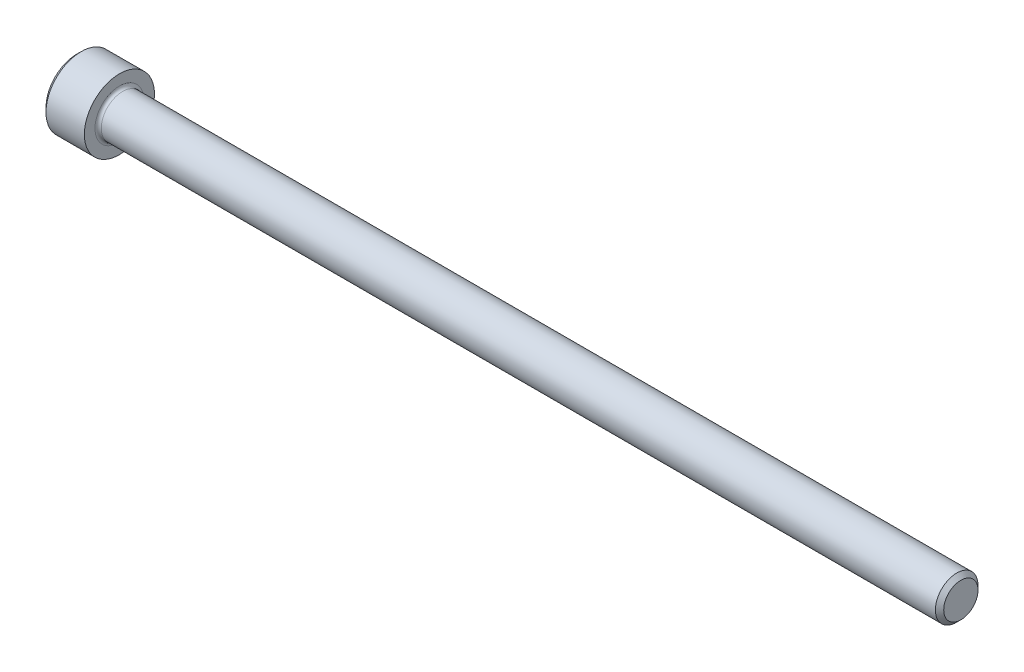
ISO-10303-21;
HEADER;
FILE_DESCRIPTION(('STEP AP214'),'2;1');
FILE_NAME('part.step','',(''),(''),'','','');
FILE_SCHEMA(('AUTOMOTIVE_DESIGN { 1 0 10303 214 1 1 1 1 }'));
ENDSEC;
DATA;
#1=APPLICATION_CONTEXT('core data for automotive mechanical design processes');
#2=APPLICATION_PROTOCOL_DEFINITION('international standard','automotive_design',2000,#1);
#3=PRODUCT_CONTEXT('',#1,'mechanical');
#4=PRODUCT('Part','Part','',(#3));
#5=PRODUCT_RELATED_PRODUCT_CATEGORY('part','',(#4));
#6=PRODUCT_DEFINITION_FORMATION('','',#4);
#7=PRODUCT_DEFINITION_CONTEXT('part definition',#1,'design');
#8=PRODUCT_DEFINITION('design','',#6,#7);
#9=PRODUCT_DEFINITION_SHAPE('','',#8);
#10=(LENGTH_UNIT() NAMED_UNIT(*) SI_UNIT(.MILLI.,.METRE.));
#11=(NAMED_UNIT(*) PLANE_ANGLE_UNIT() SI_UNIT($,.RADIAN.));
#12=(NAMED_UNIT(*) SI_UNIT($,.STERADIAN.) SOLID_ANGLE_UNIT());
#13=UNCERTAINTY_MEASURE_WITH_UNIT(LENGTH_MEASURE(1.E-05),#10,'distance_accuracy_value','');
#14=(GEOMETRIC_REPRESENTATION_CONTEXT(3) GLOBAL_UNCERTAINTY_ASSIGNED_CONTEXT((#13)) GLOBAL_UNIT_ASSIGNED_CONTEXT((#10,
#11,#12)) REPRESENTATION_CONTEXT('',''));
#15=CARTESIAN_POINT('',(0.,0.,0.));
#16=DIRECTION('',(0.,0.,1.));
#17=DIRECTION('',(1.,0.,0.));
#18=AXIS2_PLACEMENT_3D('',#15,#16,#17);
#19=CARTESIAN_POINT('',(2.286,3.4381381735323,-1.98501));
#20=DIRECTION('',(1.,0.,0.));
#21=DIRECTION('',(0.,0.,-1.));
#22=AXIS2_PLACEMENT_3D('',#19,#20,#21);
#23=PLANE('',#22);
#24=DIRECTION('',(0.,1.,0.));
#25=VECTOR('',#24,1.);
#26=CARTESIAN_POINT('',(2.286,3.4381381735323,1.98501));
#27=LINE('',#26,#25);
#28=CARTESIAN_POINT('',(2.28600000001322,0.,1.98500999999925));
#29=VERTEX_POINT('',#28);
#30=CARTESIAN_POINT('',(2.286,-1.14604605784409,1.98501));
#31=VERTEX_POINT('',#30);
#32=EDGE_CURVE('E96',#29,#31,#27,.F.);
#33=ORIENTED_EDGE('',*,*,#32,.F.);
#34=CARTESIAN_POINT('',(2.28600000002643,0.,0.));
#35=DIRECTION('',(-1.,0.,0.));
#36=DIRECTION('',(0.,0.,1.));
#37=AXIS2_PLACEMENT_3D('',#34,#35,#36);
#38=CIRCLE('',#37,1.98500999999851);
#39=CARTESIAN_POINT('',(2.28600000001322,-1.7190690867655,0.992504999999628));
#40=VERTEX_POINT('',#39);
#41=EDGE_CURVE('E98',#29,#40,#38,.F.);
#42=ORIENTED_EDGE('',*,*,#41,.T.);
#43=DIRECTION('',(0.,-0.500000000000001,-0.866025403784438));
#44=VECTOR('',#43,1.);
#45=CARTESIAN_POINT('',(2.286,-1.14604605784409,1.98501));
#46=LINE('',#45,#44);
#47=EDGE_CURVE('E101',#31,#40,#46,.T.);
#48=ORIENTED_EDGE('',*,*,#47,.F.);
#49=EDGE_LOOP('',(#33,#42,#48));
#50=FACE_BOUND('',#49,.T.);
#51=ADVANCED_FACE('F17',(#50),#23,.F.);
#52=CARTESIAN_POINT('',(2.286,3.4381381735323,-1.98501));
#53=DIRECTION('',(1.,0.,0.));
#54=DIRECTION('',(0.,0.,-1.));
#55=AXIS2_PLACEMENT_3D('',#52,#53,#54);
#56=PLANE('',#55);
#57=DIRECTION('',(0.,-0.500000000000001,-0.866025403784438));
#58=VECTOR('',#57,1.);
#59=CARTESIAN_POINT('',(2.286,-1.71906908676614,0.992504999999999));
#60=LINE('',#59,#58);
#61=CARTESIAN_POINT('',(2.286,-2.29209211568819,0.));
#62=VERTEX_POINT('',#61);
#63=EDGE_CURVE('E169',#40,#62,#60,.T.);
#64=ORIENTED_EDGE('',*,*,#63,.F.);
#65=CARTESIAN_POINT('',(2.28600000002643,0.,0.));
#66=DIRECTION('',(-1.,0.,0.));
#67=DIRECTION('',(0.,0.,1.));
#68=AXIS2_PLACEMENT_3D('',#65,#66,#67);
#69=CIRCLE('',#68,1.98500999999851);
#70=CARTESIAN_POINT('',(2.28600000001322,-1.7190690867655,-0.992504999999623));
#71=VERTEX_POINT('',#70);
#72=EDGE_CURVE('E116',#40,#71,#69,.F.);
#73=ORIENTED_EDGE('',*,*,#72,.T.);
#74=DIRECTION('',(0.,0.499999999999998,-0.86602540378444));
#75=VECTOR('',#74,1.);
#76=CARTESIAN_POINT('',(2.286,-2.29209211568819,0.));
#77=LINE('',#76,#75);
#78=EDGE_CURVE('E165',#62,#71,#77,.T.);
#79=ORIENTED_EDGE('',*,*,#78,.F.);
#80=EDGE_LOOP('',(#64,#73,#79));
#81=FACE_BOUND('',#80,.T.);
#82=ADVANCED_FACE('F341',(#81),#56,.F.);
#83=CARTESIAN_POINT('',(2.286,3.4381381735323,-1.98501));
#84=DIRECTION('',(1.,0.,0.));
#85=DIRECTION('',(0.,0.,-1.));
#86=AXIS2_PLACEMENT_3D('',#83,#84,#85);
#87=PLANE('',#86);
#88=DIRECTION('',(0.,0.499999999999998,-0.86602540378444));
#89=VECTOR('',#88,1.);
#90=CARTESIAN_POINT('',(2.286,-1.71906908676615,-0.992504999999995));
#91=LINE('',#90,#89);
#92=CARTESIAN_POINT('',(2.286,-1.1460460578441,-1.98501));
#93=VERTEX_POINT('',#92);
#94=EDGE_CURVE('E161',#71,#93,#91,.T.);
#95=ORIENTED_EDGE('',*,*,#94,.F.);
#96=CARTESIAN_POINT('',(2.28600000002643,0.,0.));
#97=DIRECTION('',(-1.,0.,0.));
#98=DIRECTION('',(0.,0.,1.));
#99=AXIS2_PLACEMENT_3D('',#96,#97,#98);
#100=CIRCLE('',#99,1.98500999999851);
#101=CARTESIAN_POINT('',(2.28600000001322,0.,-1.98500999999926));
#102=VERTEX_POINT('',#101);
#103=EDGE_CURVE('E218',#71,#102,#100,.F.);
#104=ORIENTED_EDGE('',*,*,#103,.T.);
#105=DIRECTION('',(0.,1.,0.));
#106=VECTOR('',#105,1.);
#107=CARTESIAN_POINT('',(2.286,3.4381381735323,-1.98501));
#108=LINE('',#107,#106);
#109=EDGE_CURVE('E157',#93,#102,#108,.T.);
#110=ORIENTED_EDGE('',*,*,#109,.F.);
#111=EDGE_LOOP('',(#95,#104,#110));
#112=FACE_BOUND('',#111,.T.);
#113=ADVANCED_FACE('F338',(#112),#87,.F.);
#114=CARTESIAN_POINT('',(2.286,3.4381381735323,-1.98501));
#115=DIRECTION('',(1.,0.,0.));
#116=DIRECTION('',(0.,0.,-1.));
#117=AXIS2_PLACEMENT_3D('',#114,#115,#116);
#118=PLANE('',#117);
#119=DIRECTION('',(0.,1.,0.));
#120=VECTOR('',#119,1.);
#121=CARTESIAN_POINT('',(2.286,3.4381381735323,-1.98501));
#122=LINE('',#121,#120);
#123=CARTESIAN_POINT('',(2.286,1.1460460578441,-1.98501));
#124=VERTEX_POINT('',#123);
#125=EDGE_CURVE('E153',#102,#124,#122,.T.);
#126=ORIENTED_EDGE('',*,*,#125,.F.);
#127=CARTESIAN_POINT('',(2.28600000002643,0.,0.));
#128=DIRECTION('',(-1.,0.,0.));
#129=DIRECTION('',(0.,0.,1.));
#130=AXIS2_PLACEMENT_3D('',#127,#128,#129);
#131=CIRCLE('',#130,1.98500999999851);
#132=CARTESIAN_POINT('',(2.28600000001322,1.7190690867655,-0.99250499999963));
#133=VERTEX_POINT('',#132);
#134=EDGE_CURVE('E215',#102,#133,#131,.F.);
#135=ORIENTED_EDGE('',*,*,#134,.T.);
#136=DIRECTION('',(0.,0.500000000000001,0.866025403784438));
#137=VECTOR('',#136,1.);
#138=CARTESIAN_POINT('',(2.286,1.1460460578441,-1.98501));
#139=LINE('',#138,#137);
#140=EDGE_CURVE('E149',#124,#133,#139,.T.);
#141=ORIENTED_EDGE('',*,*,#140,.F.);
#142=EDGE_LOOP('',(#126,#135,#141));
#143=FACE_BOUND('',#142,.T.);
#144=ADVANCED_FACE('F334',(#143),#118,.F.);
#145=CARTESIAN_POINT('',(2.286,3.4381381735323,-1.98501));
#146=DIRECTION('',(1.,0.,0.));
#147=DIRECTION('',(0.,0.,-1.));
#148=AXIS2_PLACEMENT_3D('',#145,#146,#147);
#149=PLANE('',#148);
#150=DIRECTION('',(0.,0.500000000000001,0.866025403784438));
#151=VECTOR('',#150,1.);
#152=CARTESIAN_POINT('',(2.286,1.71906908676615,-0.992505000000003));
#153=LINE('',#152,#151);
#154=CARTESIAN_POINT('',(2.286,2.2920921156882,0.));
#155=VERTEX_POINT('',#154);
#156=EDGE_CURVE('E145',#133,#155,#153,.T.);
#157=ORIENTED_EDGE('',*,*,#156,.F.);
#158=CARTESIAN_POINT('',(2.28600000002643,0.,0.));
#159=DIRECTION('',(-1.,0.,0.));
#160=DIRECTION('',(0.,0.,1.));
#161=AXIS2_PLACEMENT_3D('',#158,#159,#160);
#162=CIRCLE('',#161,1.98500999999851);
#163=CARTESIAN_POINT('',(2.28600000001322,1.71906908676551,0.992504999999625));
#164=VERTEX_POINT('',#163);
#165=EDGE_CURVE('E124',#133,#164,#162,.F.);
#166=ORIENTED_EDGE('',*,*,#165,.T.);
#167=DIRECTION('',(0.,-0.499999999999999,0.866025403784439));
#168=VECTOR('',#167,1.);
#169=CARTESIAN_POINT('',(2.286,2.2920921156882,0.));
#170=LINE('',#169,#168);
#171=EDGE_CURVE('E117',#155,#164,#170,.T.);
#172=ORIENTED_EDGE('',*,*,#171,.F.);
#173=EDGE_LOOP('',(#157,#166,#172));
#174=FACE_BOUND('',#173,.T.);
#175=ADVANCED_FACE('F330',(#174),#149,.F.);
#176=CARTESIAN_POINT('',(2.28600000002643,0.,0.));
#177=DIRECTION('',(-1.,0.,0.));
#178=DIRECTION('',(0.,0.,1.));
#179=AXIS2_PLACEMENT_3D('',#176,#177,#178);
#180=CONICAL_SURFACE('',#179,1.98500999999851,1.04719755119762);
#181=CARTESIAN_POINT('',(3.43204605781011,0.,5.6843418860808E-11));
#182=VERTEX_POINT('',#181);
#183=VERTEX_LOOP('',#182);
#184=FACE_BOUND('',#183,.T.);
#185=ORIENTED_EDGE('',*,*,#41,.F.);
#186=CARTESIAN_POINT('',(2.28600000002643,0.,0.));
#187=DIRECTION('',(-1.,0.,0.));
#188=DIRECTION('',(0.,0.,1.));
#189=AXIS2_PLACEMENT_3D('',#186,#187,#188);
#190=CIRCLE('',#189,1.98500999999851);
#191=EDGE_CURVE('E112',#29,#164,#190,.T.);
#192=ORIENTED_EDGE('',*,*,#191,.T.);
#193=ORIENTED_EDGE('',*,*,#165,.F.);
#194=ORIENTED_EDGE('',*,*,#134,.F.);
#195=ORIENTED_EDGE('',*,*,#103,.F.);
#196=ORIENTED_EDGE('',*,*,#72,.F.);
#197=EDGE_LOOP('',(#185,#192,#193,#194,#195,#196));
#198=FACE_BOUND('',#197,.T.);
#199=ADVANCED_FACE('F110',(#184,#198),#180,.F.);
#200=CARTESIAN_POINT('',(2.286,3.4381381735323,-1.98501));
#201=DIRECTION('',(1.,0.,0.));
#202=DIRECTION('',(0.,0.,-1.));
#203=AXIS2_PLACEMENT_3D('',#200,#201,#202);
#204=PLANE('',#203);
#205=DIRECTION('',(0.,0.499999999999999,-0.866025403784439));
#206=VECTOR('',#205,1.);
#207=CARTESIAN_POINT('',(2.286,2.2920921156882,0.));
#208=LINE('',#207,#206);
#209=CARTESIAN_POINT('',(2.286,1.1460460578441,1.98501));
#210=VERTEX_POINT('',#209);
#211=EDGE_CURVE('E123',#164,#210,#208,.F.);
#212=ORIENTED_EDGE('',*,*,#211,.F.);
#213=ORIENTED_EDGE('',*,*,#191,.F.);
#214=DIRECTION('',(0.,-1.,0.));
#215=VECTOR('',#214,1.);
#216=CARTESIAN_POINT('',(2.286,-1.14604605784409,1.98501));
#217=LINE('',#216,#215);
#218=EDGE_CURVE('E121',#29,#210,#217,.F.);
#219=ORIENTED_EDGE('',*,*,#218,.T.);
#220=EDGE_LOOP('',(#212,#213,#219));
#221=FACE_BOUND('',#220,.T.);
#222=ADVANCED_FACE('F120',(#221),#204,.F.);
#223=CARTESIAN_POINT('',(2.286,2.2920921156882,0.));
#224=DIRECTION('',(0.,-0.866025403784439,-0.499999999999999));
#225=DIRECTION('',(0.,0.499999999999999,-0.866025403784439));
#226=AXIS2_PLACEMENT_3D('',#223,#224,#225);
#227=PLANE('',#226);
#228=ORIENTED_EDGE('',*,*,#211,.T.);
#229=DIRECTION('',(1.,0.,0.));
#230=VECTOR('',#229,1.);
#231=CARTESIAN_POINT('',(2.286,1.1460460578441,1.98501));
#232=LINE('',#231,#230);
#233=CARTESIAN_POINT('',(0.,1.1460460578441,1.98501));
#234=VERTEX_POINT('',#233);
#235=EDGE_CURVE('E129',#210,#234,#232,.F.);
#236=ORIENTED_EDGE('',*,*,#235,.T.);
#237=DIRECTION('',(0.,-0.499999999999999,0.866025403784439));
#238=VECTOR('',#237,1.);
#239=CARTESIAN_POINT('',(0.,2.2920921156882,0.));
#240=LINE('',#239,#238);
#241=CARTESIAN_POINT('',(0.,2.2920921156882,0.));
#242=VERTEX_POINT('',#241);
#243=EDGE_CURVE('E136',#242,#234,#240,.T.);
#244=ORIENTED_EDGE('',*,*,#243,.F.);
#245=DIRECTION('',(1.,0.,0.));
#246=VECTOR('',#245,1.);
#247=CARTESIAN_POINT('',(2.286,2.2920921156882,0.));
#248=LINE('',#247,#246);
#249=EDGE_CURVE('E180',#242,#155,#248,.T.);
#250=ORIENTED_EDGE('',*,*,#249,.T.);
#251=ORIENTED_EDGE('',*,*,#171,.T.);
#252=EDGE_LOOP('',(#228,#236,#244,#250,#251));
#253=FACE_BOUND('',#252,.T.);
#254=ADVANCED_FACE('F322',(#253),#227,.T.);
#255=CARTESIAN_POINT('',(2.286,-1.14604605784409,1.98501));
#256=DIRECTION('',(0.,0.,1.));
#257=DIRECTION('',(0.,-1.,0.));
#258=AXIS2_PLACEMENT_3D('',#255,#256,#257);
#259=PLANE('',#258);
#260=ORIENTED_EDGE('',*,*,#235,.F.);
#261=ORIENTED_EDGE('',*,*,#218,.F.);
#262=ORIENTED_EDGE('',*,*,#32,.T.);
#263=DIRECTION('',(1.,0.,0.));
#264=VECTOR('',#263,1.);
#265=CARTESIAN_POINT('',(2.286,-1.14604605784409,1.98501));
#266=LINE('',#265,#264);
#267=CARTESIAN_POINT('',(0.,-1.14604605784409,1.98501));
#268=VERTEX_POINT('',#267);
#269=EDGE_CURVE('E131',#268,#31,#266,.T.);
#270=ORIENTED_EDGE('',*,*,#269,.F.);
#271=DIRECTION('',(0.,1.,0.));
#272=VECTOR('',#271,1.);
#273=CARTESIAN_POINT('',(0.,0.,1.98501));
#274=LINE('',#273,#272);
#275=EDGE_CURVE('E364',#234,#268,#274,.F.);
#276=ORIENTED_EDGE('',*,*,#275,.F.);
#277=EDGE_LOOP('',(#260,#261,#262,#270,#276));
#278=FACE_BOUND('',#277,.T.);
#279=ADVANCED_FACE('F127',(#278),#259,.F.);
#280=CARTESIAN_POINT('',(2.286,-1.14604605784409,1.98501));
#281=DIRECTION('',(0.,0.866025403784438,-0.500000000000001));
#282=DIRECTION('',(0.,0.500000000000001,0.866025403784438));
#283=AXIS2_PLACEMENT_3D('',#280,#281,#282);
#284=PLANE('',#283);
#285=ORIENTED_EDGE('',*,*,#63,.T.);
#286=DIRECTION('',(1.,0.,0.));
#287=VECTOR('',#286,1.);
#288=CARTESIAN_POINT('',(2.286,-2.29209211568819,0.));
#289=LINE('',#288,#287);
#290=CARTESIAN_POINT('',(0.,-2.29209211568819,0.));
#291=VERTEX_POINT('',#290);
#292=EDGE_CURVE('E191',#291,#62,#289,.T.);
#293=ORIENTED_EDGE('',*,*,#292,.F.);
#294=DIRECTION('',(0.,-0.500000000000001,-0.866025403784438));
#295=VECTOR('',#294,1.);
#296=CARTESIAN_POINT('',(0.,-1.14604605784409,1.98501));
#297=LINE('',#296,#295);
#298=EDGE_CURVE('E360',#268,#291,#297,.T.);
#299=ORIENTED_EDGE('',*,*,#298,.F.);
#300=ORIENTED_EDGE('',*,*,#269,.T.);
#301=ORIENTED_EDGE('',*,*,#47,.T.);
#302=EDGE_LOOP('',(#285,#293,#299,#300,#301));
#303=FACE_BOUND('',#302,.T.);
#304=ADVANCED_FACE('F315',(#303),#284,.T.);
#305=CARTESIAN_POINT('',(2.286,-2.29209211568819,0.));
#306=DIRECTION('',(0.,0.86602540378444,0.499999999999998));
#307=DIRECTION('',(0.,-0.499999999999998,0.86602540378444));
#308=AXIS2_PLACEMENT_3D('',#305,#306,#307);
#309=PLANE('',#308);
#310=ORIENTED_EDGE('',*,*,#94,.T.);
#311=DIRECTION('',(1.,0.,0.));
#312=VECTOR('',#311,1.);
#313=CARTESIAN_POINT('',(2.286,-1.1460460578441,-1.98501));
#314=LINE('',#313,#312);
#315=CARTESIAN_POINT('',(0.,-1.1460460578441,-1.98501));
#316=VERTEX_POINT('',#315);
#317=EDGE_CURVE('E184',#93,#316,#314,.F.);
#318=ORIENTED_EDGE('',*,*,#317,.T.);
#319=DIRECTION('',(0.,0.499999999999998,-0.86602540378444));
#320=VECTOR('',#319,1.);
#321=CARTESIAN_POINT('',(0.,-2.29209211568819,0.));
#322=LINE('',#321,#320);
#323=EDGE_CURVE('E353',#291,#316,#322,.T.);
#324=ORIENTED_EDGE('',*,*,#323,.F.);
#325=ORIENTED_EDGE('',*,*,#292,.T.);
#326=ORIENTED_EDGE('',*,*,#78,.T.);
#327=EDGE_LOOP('',(#310,#318,#324,#325,#326));
#328=FACE_BOUND('',#327,.T.);
#329=ADVANCED_FACE('F311',(#328),#309,.T.);
#330=CARTESIAN_POINT('',(2.286,1.1460460578441,-1.98501));
#331=DIRECTION('',(0.,0.,-1.));
#332=DIRECTION('',(0.,1.,0.));
#333=AXIS2_PLACEMENT_3D('',#330,#331,#332);
#334=PLANE('',#333);
#335=ORIENTED_EDGE('',*,*,#317,.F.);
#336=ORIENTED_EDGE('',*,*,#109,.T.);
#337=ORIENTED_EDGE('',*,*,#125,.T.);
#338=DIRECTION('',(1.,0.,0.));
#339=VECTOR('',#338,1.);
#340=CARTESIAN_POINT('',(2.286,1.1460460578441,-1.98501));
#341=LINE('',#340,#339);
#342=CARTESIAN_POINT('',(0.,1.1460460578441,-1.98501));
#343=VERTEX_POINT('',#342);
#344=EDGE_CURVE('E183',#124,#343,#341,.F.);
#345=ORIENTED_EDGE('',*,*,#344,.T.);
#346=DIRECTION('',(0.,1.,0.));
#347=VECTOR('',#346,1.);
#348=CARTESIAN_POINT('',(0.,0.,-1.98501));
#349=LINE('',#348,#347);
#350=EDGE_CURVE('E359',#316,#343,#349,.T.);
#351=ORIENTED_EDGE('',*,*,#350,.F.);
#352=EDGE_LOOP('',(#335,#336,#337,#345,#351));
#353=FACE_BOUND('',#352,.T.);
#354=ADVANCED_FACE('F307',(#353),#334,.F.);
#355=CARTESIAN_POINT('',(2.286,2.2920921156882,0.));
#356=DIRECTION('',(0.,0.866025403784438,-0.500000000000001));
#357=DIRECTION('',(0.,0.500000000000001,0.866025403784438));
#358=AXIS2_PLACEMENT_3D('',#355,#356,#357);
#359=PLANE('',#358);
#360=ORIENTED_EDGE('',*,*,#344,.F.);
#361=ORIENTED_EDGE('',*,*,#140,.T.);
#362=ORIENTED_EDGE('',*,*,#156,.T.);
#363=ORIENTED_EDGE('',*,*,#249,.F.);
#364=DIRECTION('',(0.,0.500000000000001,0.866025403784438));
#365=VECTOR('',#364,1.);
#366=CARTESIAN_POINT('',(0.,1.1460460578441,-1.98501));
#367=LINE('',#366,#365);
#368=EDGE_CURVE('E211',#343,#242,#367,.T.);
#369=ORIENTED_EDGE('',*,*,#368,.F.);
#370=EDGE_LOOP('',(#360,#361,#362,#363,#369));
#371=FACE_BOUND('',#370,.T.);
#372=ADVANCED_FACE('F303',(#371),#359,.F.);
#373=CARTESIAN_POINT('',(0.,0.,0.));
#374=DIRECTION('',(-1.,0.,0.));
#375=DIRECTION('',(0.,0.,1.));
#376=AXIS2_PLACEMENT_3D('',#373,#374,#375);
#377=PLANE('',#376);
#378=CARTESIAN_POINT('',(-5.6843418860808E-11,0.,0.));
#379=DIRECTION('',(1.,0.,0.));
#380=DIRECTION('',(0.,0.,-1.));
#381=AXIS2_PLACEMENT_3D('',#378,#379,#380);
#382=CIRCLE('',#381,3.48614999995789);
#383=CARTESIAN_POINT('',(-5.6843418860808E-11,0.,-3.48614999995789));
#384=VERTEX_POINT('',#383);
#385=EDGE_CURVE('E209',#384,#384,#382,.T.);
#386=ORIENTED_EDGE('',*,*,#385,.F.);
#387=EDGE_LOOP('',(#386));
#388=FACE_BOUND('',#387,.T.);
#389=ORIENTED_EDGE('',*,*,#350,.T.);
#390=ORIENTED_EDGE('',*,*,#368,.T.);
#391=ORIENTED_EDGE('',*,*,#243,.T.);
#392=ORIENTED_EDGE('',*,*,#275,.T.);
#393=ORIENTED_EDGE('',*,*,#298,.T.);
#394=ORIENTED_EDGE('',*,*,#323,.T.);
#395=EDGE_LOOP('',(#389,#390,#391,#392,#393,#394));
#396=FACE_BOUND('',#395,.T.);
#397=ADVANCED_FACE('F295',(#388,#396),#377,.T.);
#398=CARTESIAN_POINT('',(0.482599999941158,0.,0.));
#399=DIRECTION('',(1.,0.,0.));
#400=DIRECTION('',(0.,0.,-1.));
#401=AXIS2_PLACEMENT_3D('',#398,#399,#400);
#402=CONICAL_SURFACE('',#401,3.96874999989905,0.785398163338555);
#403=ORIENTED_EDGE('',*,*,#385,.T.);
#404=EDGE_LOOP('',(#403));
#405=FACE_BOUND('',#404,.T.);
#406=CARTESIAN_POINT('',(0.4826,0.,0.));
#407=DIRECTION('',(-1.,0.,0.));
#408=DIRECTION('',(0.,0.,1.));
#409=AXIS2_PLACEMENT_3D('',#406,#407,#408);
#410=CIRCLE('',#409,3.96875);
#411=CARTESIAN_POINT('',(0.4826,0.,3.96875));
#412=VERTEX_POINT('',#411);
#413=EDGE_CURVE('E208',#412,#412,#410,.F.);
#414=ORIENTED_EDGE('',*,*,#413,.F.);
#415=EDGE_LOOP('',(#414));
#416=FACE_BOUND('',#415,.T.);
#417=ADVANCED_FACE('F290',(#405,#416),#402,.T.);
#418=CARTESIAN_POINT('',(-31.75,0.,0.));
#419=DIRECTION('',(-1.,0.,0.));
#420=DIRECTION('',(0.,0.,1.));
#421=AXIS2_PLACEMENT_3D('',#418,#419,#420);
#422=CYLINDRICAL_SURFACE('',#421,3.96875);
#423=CARTESIAN_POINT('',(4.826,0.,0.));
#424=DIRECTION('',(-1.,0.,0.));
#425=DIRECTION('',(0.,0.,1.));
#426=AXIS2_PLACEMENT_3D('',#423,#424,#425);
#427=CIRCLE('',#426,3.96875);
#428=CARTESIAN_POINT('',(4.826,0.,3.96875));
#429=VERTEX_POINT('',#428);
#430=EDGE_CURVE('E205',#429,#429,#427,.F.);
#431=ORIENTED_EDGE('',*,*,#430,.F.);
#432=EDGE_LOOP('',(#431));
#433=FACE_BOUND('',#432,.T.);
#434=ORIENTED_EDGE('',*,*,#413,.T.);
#435=EDGE_LOOP('',(#434));
#436=FACE_BOUND('',#435,.T.);
#437=ADVANCED_FACE('F286',(#433,#436),#422,.T.);
#438=CARTESIAN_POINT('',(100.076,1.94056,0.));
#439=DIRECTION('',(1.,0.,0.));
#440=DIRECTION('',(0.,0.,-1.));
#441=AXIS2_PLACEMENT_3D('',#438,#439,#440);
#442=PLANE('',#441);
#443=CARTESIAN_POINT('',(100.076000000058,0.,0.));
#444=DIRECTION('',(-1.,0.,0.));
#445=DIRECTION('',(0.,0.,1.));
#446=AXIS2_PLACEMENT_3D('',#443,#444,#445);
#447=CIRCLE('',#446,1.94055999998);
#448=CARTESIAN_POINT('',(100.076000000058,0.,1.94055999998));
#449=VERTEX_POINT('',#448);
#450=EDGE_CURVE('E201',#449,#449,#447,.T.);
#451=ORIENTED_EDGE('',*,*,#450,.F.);
#452=EDGE_LOOP('',(#451));
#453=FACE_BOUND('',#452,.T.);
#454=ADVANCED_FACE('F244',(#453),#442,.T.);
#455=CARTESIAN_POINT('',(4.826,3.96875,0.));
#456=DIRECTION('',(1.,0.,0.));
#457=DIRECTION('',(0.,0.,-1.));
#458=AXIS2_PLACEMENT_3D('',#455,#456,#457);
#459=PLANE('',#458);
#460=ORIENTED_EDGE('',*,*,#430,.T.);
#461=EDGE_LOOP('',(#460));
#462=FACE_BOUND('',#461,.T.);
#463=CARTESIAN_POINT('',(4.826,0.,0.));
#464=DIRECTION('',(1.,0.,0.));
#465=DIRECTION('',(0.,0.,1.));
#466=AXIS2_PLACEMENT_3D('',#463,#464,#465);
#467=CIRCLE('',#466,2.7686);
#468=CARTESIAN_POINT('',(4.826,0.,-2.7686));
#469=VERTEX_POINT('',#468);
#470=CARTESIAN_POINT('',(4.826,0.,2.7686));
#471=VERTEX_POINT('',#470);
#472=EDGE_CURVE('E204',#469,#471,#467,.F.);
#473=ORIENTED_EDGE('',*,*,#472,.T.);
#474=CARTESIAN_POINT('',(4.826,0.,0.));
#475=DIRECTION('',(1.,0.,0.));
#476=DIRECTION('',(0.,0.,-1.));
#477=AXIS2_PLACEMENT_3D('',#474,#475,#476);
#478=CIRCLE('',#477,2.7686);
#479=EDGE_CURVE('E36',#471,#469,#478,.F.);
#480=ORIENTED_EDGE('',*,*,#479,.T.);
#481=EDGE_LOOP('',(#473,#480));
#482=FACE_BOUND('',#481,.T.);
#483=ADVANCED_FACE('F225',(#462,#482),#459,.T.);
#484=CARTESIAN_POINT('',(99.6035600001051,0.,0.));
#485=DIRECTION('',(-1.,0.,0.));
#486=DIRECTION('',(0.,0.,1.));
#487=AXIS2_PLACEMENT_3D('',#484,#485,#486);
#488=CONICAL_SURFACE('',#487,2.41299999993316,0.785398163397448);
#489=CARTESIAN_POINT('',(99.60356,0.,0.));
#490=DIRECTION('',(-1.,0.,0.));
#491=DIRECTION('',(0.,0.,1.));
#492=AXIS2_PLACEMENT_3D('',#489,#490,#491);
#493=CIRCLE('',#492,2.413);
#494=CARTESIAN_POINT('',(99.60356,0.,2.413));
#495=VERTEX_POINT('',#494);
#496=EDGE_CURVE('E28',#495,#495,#493,.T.);
#497=ORIENTED_EDGE('',*,*,#496,.F.);
#498=EDGE_LOOP('',(#497));
#499=FACE_BOUND('',#498,.T.);
#500=ORIENTED_EDGE('',*,*,#450,.T.);
#501=EDGE_LOOP('',(#500));
#502=FACE_BOUND('',#501,.T.);
#503=ADVANCED_FACE('F243',(#499,#502),#488,.T.);
#504=CARTESIAN_POINT('',(5.1816,0.,0.));
#505=DIRECTION('',(1.,0.,0.));
#506=DIRECTION('',(0.,0.,-1.));
#507=AXIS2_PLACEMENT_3D('',#504,#505,#506);
#508=TOROIDAL_SURFACE('',#507,2.7686,0.3556);
#509=CARTESIAN_POINT('',(5.1816,0.,0.));
#510=DIRECTION('',(-1.,0.,0.));
#511=DIRECTION('',(0.,0.,1.));
#512=AXIS2_PLACEMENT_3D('',#509,#510,#511);
#513=CIRCLE('',#512,2.413);
#514=CARTESIAN_POINT('',(5.1816,0.,2.413));
#515=VERTEX_POINT('',#514);
#516=EDGE_CURVE('E11',#515,#515,#513,.F.);
#517=ORIENTED_EDGE('',*,*,#516,.F.);
#518=EDGE_LOOP('',(#517));
#519=FACE_BOUND('',#518,.T.);
#520=ORIENTED_EDGE('',*,*,#472,.F.);
#521=ORIENTED_EDGE('',*,*,#479,.F.);
#522=EDGE_LOOP('',(#520,#521));
#523=FACE_BOUND('',#522,.T.);
#524=ADVANCED_FACE('F222',(#519,#523),#508,.F.);
#525=CARTESIAN_POINT('',(-31.75,0.,0.));
#526=DIRECTION('',(-1.,0.,0.));
#527=DIRECTION('',(0.,0.,1.));
#528=AXIS2_PLACEMENT_3D('',#525,#526,#527);
#529=CYLINDRICAL_SURFACE('',#528,2.413);
#530=ORIENTED_EDGE('',*,*,#516,.T.);
#531=EDGE_LOOP('',(#530));
#532=FACE_BOUND('',#531,.T.);
#533=ORIENTED_EDGE('',*,*,#496,.T.);
#534=EDGE_LOOP('',(#533));
#535=FACE_BOUND('',#534,.T.);
#536=ADVANCED_FACE('F268',(#532,#535),#529,.T.);
#537=CLOSED_SHELL('',(#51,#82,#113,#144,#175,#199,#222,#254,#279,#304,#329,#354,#372,#397,#417,
#437,#454,#483,#503,#524,#536));
#538=MANIFOLD_SOLID_BREP('B1',#537);
#539=ADVANCED_BREP_SHAPE_REPRESENTATION('',(#18,#538),#14);
#540=SHAPE_DEFINITION_REPRESENTATION(#9,#539);
ENDSEC;
END-ISO-10303-21;
